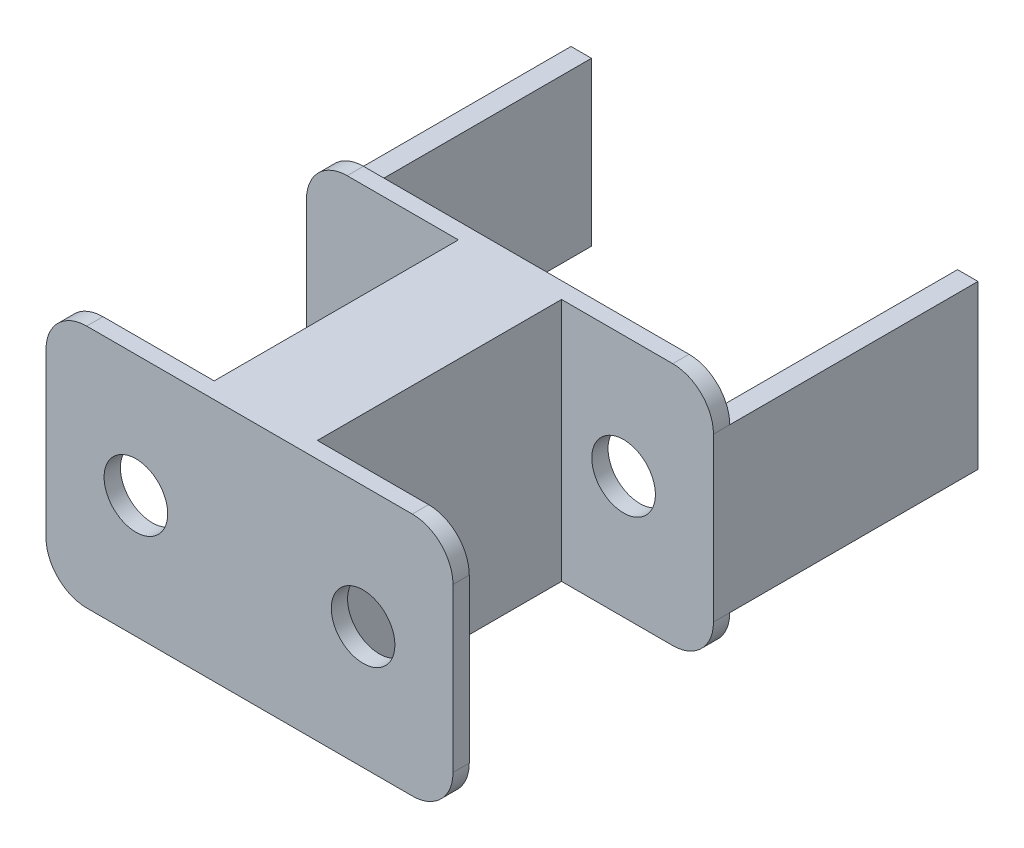
ISO-10303-21;
HEADER;
FILE_DESCRIPTION(('STEP AP214'),'2;1');
FILE_NAME('part.step','',(''),(''),'','','');
FILE_SCHEMA(('AUTOMOTIVE_DESIGN { 1 0 10303 214 1 1 1 1 }'));
ENDSEC;
DATA;
#1=APPLICATION_CONTEXT('core data for automotive mechanical design processes');
#2=APPLICATION_PROTOCOL_DEFINITION('international standard','automotive_design',2000,#1);
#3=PRODUCT_CONTEXT('',#1,'mechanical');
#4=PRODUCT('Part','Part','',(#3));
#5=PRODUCT_RELATED_PRODUCT_CATEGORY('part','',(#4));
#6=PRODUCT_DEFINITION_FORMATION('','',#4);
#7=PRODUCT_DEFINITION_CONTEXT('part definition',#1,'design');
#8=PRODUCT_DEFINITION('design','',#6,#7);
#9=PRODUCT_DEFINITION_SHAPE('','',#8);
#10=(LENGTH_UNIT() NAMED_UNIT(*) SI_UNIT(.MILLI.,.METRE.));
#11=(NAMED_UNIT(*) PLANE_ANGLE_UNIT() SI_UNIT($,.RADIAN.));
#12=(NAMED_UNIT(*) SI_UNIT($,.STERADIAN.) SOLID_ANGLE_UNIT());
#13=UNCERTAINTY_MEASURE_WITH_UNIT(LENGTH_MEASURE(1.E-05),#10,'distance_accuracy_value','');
#14=(GEOMETRIC_REPRESENTATION_CONTEXT(3) GLOBAL_UNCERTAINTY_ASSIGNED_CONTEXT((#13)) GLOBAL_UNIT_ASSIGNED_CONTEXT((#10,
#11,#12)) REPRESENTATION_CONTEXT('',''));
#15=CARTESIAN_POINT('',(0.,0.,0.));
#16=DIRECTION('',(0.,0.,1.));
#17=DIRECTION('',(1.,0.,0.));
#18=AXIS2_PLACEMENT_3D('',#15,#16,#17);
#19=CARTESIAN_POINT('',(-90.,10.,0.));
#20=DIRECTION('',(0.,0.,1.));
#21=DIRECTION('',(1.,0.,0.));
#22=AXIS2_PLACEMENT_3D('',#19,#20,#21);
#23=PLANE('',#22);
#24=CARTESIAN_POINT('',(-77.9117533397812,30.0000000000002,0.));
#25=DIRECTION('',(0.,0.,-1.));
#26=DIRECTION('',(-1.,0.,0.));
#27=AXIS2_PLACEMENT_3D('',#24,#25,#26);
#28=CIRCLE('',#27,7.81529093513876);
#29=CARTESIAN_POINT('',(-85.72704427492,30.0000000000002,0.));
#30=VERTEX_POINT('',#29);
#31=EDGE_CURVE('E288',#30,#30,#28,.T.);
#32=ORIENTED_EDGE('',*,*,#31,.F.);
#33=EDGE_LOOP('',(#32));
#34=FACE_BOUND('',#33,.T.);
#35=CARTESIAN_POINT('',(-22.0882466602188,30.0000000000002,0.));
#36=DIRECTION('',(0.,0.,1.));
#37=DIRECTION('',(1.,0.,0.));
#38=AXIS2_PLACEMENT_3D('',#35,#36,#37);
#39=CIRCLE('',#38,7.81529093513875);
#40=CARTESIAN_POINT('',(-14.27295572508,30.0000000000002,0.));
#41=VERTEX_POINT('',#40);
#42=EDGE_CURVE('E300',#41,#41,#39,.T.);
#43=ORIENTED_EDGE('',*,*,#42,.T.);
#44=EDGE_LOOP('',(#43));
#45=FACE_BOUND('',#44,.T.);
#46=DIRECTION('',(1.,0.,0.));
#47=VECTOR('',#46,1.);
#48=CARTESIAN_POINT('',(-100.,49.9999999999999,0.));
#49=LINE('',#48,#47);
#50=CARTESIAN_POINT('',(-100.,49.9999999999999,0.));
#51=VERTEX_POINT('',#50);
#52=CARTESIAN_POINT('',(-94.9706668128813,49.9999999999999,0.));
#53=VERTEX_POINT('',#52);
#54=EDGE_CURVE('E241',#51,#53,#49,.T.);
#55=ORIENTED_EDGE('',*,*,#54,.F.);
#56=CARTESIAN_POINT('',(-90.,50.,0.));
#57=DIRECTION('',(0.,0.,1.));
#58=DIRECTION('',(1.,0.,0.));
#59=AXIS2_PLACEMENT_3D('',#56,#57,#58);
#60=CIRCLE('',#59,9.99999999999999);
#61=CARTESIAN_POINT('',(-89.9999999999999,60.,0.));
#62=VERTEX_POINT('',#61);
#63=EDGE_CURVE('E405',#62,#51,#60,.T.);
#64=ORIENTED_EDGE('',*,*,#63,.F.);
#65=DIRECTION('',(-1.,0.,0.));
#66=VECTOR('',#65,1.);
#67=CARTESIAN_POINT('',(-89.9999999999999,60.,0.));
#68=LINE('',#67,#66);
#69=CARTESIAN_POINT('',(-10.0000000000001,60.,0.));
#70=VERTEX_POINT('',#69);
#71=EDGE_CURVE('E442',#70,#62,#68,.T.);
#72=ORIENTED_EDGE('',*,*,#71,.F.);
#73=CARTESIAN_POINT('',(-10.,50.,0.));
#74=DIRECTION('',(0.,0.,1.));
#75=DIRECTION('',(1.,0.,0.));
#76=AXIS2_PLACEMENT_3D('',#73,#74,#75);
#77=CIRCLE('',#76,10.);
#78=CARTESIAN_POINT('',(0.,49.9999999999999,0.));
#79=VERTEX_POINT('',#78);
#80=EDGE_CURVE('E438',#79,#70,#77,.T.);
#81=ORIENTED_EDGE('',*,*,#80,.F.);
#82=DIRECTION('',(1.,0.,0.));
#83=VECTOR('',#82,1.);
#84=CARTESIAN_POINT('',(0.,49.9999999999999,0.));
#85=LINE('',#84,#83);
#86=CARTESIAN_POINT('',(-5.02933318711873,49.9999999999999,0.));
#87=VERTEX_POINT('',#86);
#88=EDGE_CURVE('E57',#87,#79,#85,.T.);
#89=ORIENTED_EDGE('',*,*,#88,.F.);
#90=DIRECTION('',(0.,1.,0.));
#91=VECTOR('',#90,1.);
#92=CARTESIAN_POINT('',(-5.02933318711873,49.9999999999999,0.));
#93=LINE('',#92,#91);
#94=CARTESIAN_POINT('',(-5.02933318711873,10.0000000000001,0.));
#95=VERTEX_POINT('',#94);
#96=EDGE_CURVE('E249',#95,#87,#93,.T.);
#97=ORIENTED_EDGE('',*,*,#96,.F.);
#98=DIRECTION('',(-1.,0.,0.));
#99=VECTOR('',#98,1.);
#100=CARTESIAN_POINT('',(0.,10.0000000000001,0.));
#101=LINE('',#100,#99);
#102=CARTESIAN_POINT('',(0.,10.0000000000001,0.));
#103=VERTEX_POINT('',#102);
#104=EDGE_CURVE('E244',#103,#95,#101,.T.);
#105=ORIENTED_EDGE('',*,*,#104,.F.);
#106=CARTESIAN_POINT('',(-10.,10.,0.));
#107=DIRECTION('',(0.,0.,1.));
#108=DIRECTION('',(1.,0.,0.));
#109=AXIS2_PLACEMENT_3D('',#106,#107,#108);
#110=CIRCLE('',#109,10.);
#111=CARTESIAN_POINT('',(-10.0000000000001,0.,0.));
#112=VERTEX_POINT('',#111);
#113=EDGE_CURVE('E434',#112,#103,#110,.T.);
#114=ORIENTED_EDGE('',*,*,#113,.F.);
#115=DIRECTION('',(1.,0.,0.));
#116=VECTOR('',#115,1.);
#117=CARTESIAN_POINT('',(-89.9999999999999,0.,0.));
#118=LINE('',#117,#116);
#119=CARTESIAN_POINT('',(-89.9999999999999,0.,0.));
#120=VERTEX_POINT('',#119);
#121=EDGE_CURVE('E430',#120,#112,#118,.T.);
#122=ORIENTED_EDGE('',*,*,#121,.F.);
#123=CARTESIAN_POINT('',(-90.,10.,0.));
#124=DIRECTION('',(0.,0.,1.));
#125=DIRECTION('',(1.,0.,0.));
#126=AXIS2_PLACEMENT_3D('',#123,#124,#125);
#127=CIRCLE('',#126,10.);
#128=CARTESIAN_POINT('',(-100.,10.0000000000001,0.));
#129=VERTEX_POINT('',#128);
#130=EDGE_CURVE('E399',#129,#120,#127,.T.);
#131=ORIENTED_EDGE('',*,*,#130,.F.);
#132=DIRECTION('',(-1.,0.,0.));
#133=VECTOR('',#132,1.);
#134=CARTESIAN_POINT('',(-100.,10.0000000000001,0.));
#135=LINE('',#134,#133);
#136=CARTESIAN_POINT('',(-94.9706668128813,10.0000000000001,0.));
#137=VERTEX_POINT('',#136);
#138=EDGE_CURVE('E237',#137,#129,#135,.T.);
#139=ORIENTED_EDGE('',*,*,#138,.F.);
#140=DIRECTION('',(0.,-1.,0.));
#141=VECTOR('',#140,1.);
#142=CARTESIAN_POINT('',(-94.9706668128813,49.9999999999999,0.));
#143=LINE('',#142,#141);
#144=EDGE_CURVE('E572',#53,#137,#143,.T.);
#145=ORIENTED_EDGE('',*,*,#144,.F.);
#146=EDGE_LOOP('',(#55,#64,#72,#81,#89,#97,#105,#114,#122,#131,#139,#145));
#147=FACE_BOUND('',#146,.T.);
#148=ADVANCED_FACE('F39',(#34,#45,#147),#23,.F.);
#149=CARTESIAN_POINT('',(-90.,10.,68.));
#150=DIRECTION('',(0.,0.,-1.));
#151=DIRECTION('',(-1.,0.,0.));
#152=AXIS2_PLACEMENT_3D('',#149,#150,#151);
#153=CYLINDRICAL_SURFACE('',#152,10.);
#154=DIRECTION('',(0.,0.,-1.));
#155=VECTOR('',#154,1.);
#156=CARTESIAN_POINT('',(-89.9999999999999,0.,68.));
#157=LINE('',#156,#155);
#158=CARTESIAN_POINT('',(-89.9999999999999,0.,4.));
#159=VERTEX_POINT('',#158);
#160=EDGE_CURVE('E483',#159,#120,#157,.T.);
#161=ORIENTED_EDGE('',*,*,#160,.F.);
#162=CARTESIAN_POINT('',(-90.,10.,4.));
#163=DIRECTION('',(0.,0.,-1.));
#164=DIRECTION('',(-1.,0.,0.));
#165=AXIS2_PLACEMENT_3D('',#162,#163,#164);
#166=CIRCLE('',#165,10.);
#167=CARTESIAN_POINT('',(-100.,10.0000000000001,4.));
#168=VERTEX_POINT('',#167);
#169=EDGE_CURVE('E371',#159,#168,#166,.T.);
#170=ORIENTED_EDGE('',*,*,#169,.T.);
#171=DIRECTION('',(0.,0.,-1.));
#172=VECTOR('',#171,1.);
#173=CARTESIAN_POINT('',(-100.,10.0000000000001,68.));
#174=LINE('',#173,#172);
#175=EDGE_CURVE('E426',#168,#129,#174,.T.);
#176=ORIENTED_EDGE('',*,*,#175,.T.);
#177=ORIENTED_EDGE('',*,*,#130,.T.);
#178=EDGE_LOOP('',(#161,#170,#176,#177));
#179=FACE_BOUND('',#178,.T.);
#180=ADVANCED_FACE('F538',(#179),#153,.T.);
#181=CARTESIAN_POINT('',(-10.,10.,68.));
#182=DIRECTION('',(0.,0.,-1.));
#183=DIRECTION('',(-1.,0.,0.));
#184=AXIS2_PLACEMENT_3D('',#181,#182,#183);
#185=CYLINDRICAL_SURFACE('',#184,10.);
#186=DIRECTION('',(0.,0.,-1.));
#187=VECTOR('',#186,1.);
#188=CARTESIAN_POINT('',(0.,10.0000000000001,68.));
#189=LINE('',#188,#187);
#190=CARTESIAN_POINT('',(0.,10.0000000000001,4.));
#191=VERTEX_POINT('',#190);
#192=EDGE_CURVE('E473',#191,#103,#189,.T.);
#193=ORIENTED_EDGE('',*,*,#192,.F.);
#194=CARTESIAN_POINT('',(-10.,10.,4.));
#195=DIRECTION('',(0.,0.,-1.));
#196=DIRECTION('',(-1.,0.,0.));
#197=AXIS2_PLACEMENT_3D('',#194,#195,#196);
#198=CIRCLE('',#197,10.);
#199=CARTESIAN_POINT('',(-10.,0.,4.));
#200=VERTEX_POINT('',#199);
#201=EDGE_CURVE('E395',#191,#200,#198,.T.);
#202=ORIENTED_EDGE('',*,*,#201,.T.);
#203=DIRECTION('',(0.,0.,-1.));
#204=VECTOR('',#203,1.);
#205=CARTESIAN_POINT('',(-10.0000000000001,0.,68.));
#206=LINE('',#205,#204);
#207=EDGE_CURVE('E478',#200,#112,#206,.T.);
#208=ORIENTED_EDGE('',*,*,#207,.T.);
#209=ORIENTED_EDGE('',*,*,#113,.T.);
#210=EDGE_LOOP('',(#193,#202,#208,#209));
#211=FACE_BOUND('',#210,.T.);
#212=ADVANCED_FACE('F520',(#211),#185,.T.);
#213=CARTESIAN_POINT('',(0.,49.9999999999999,68.));
#214=DIRECTION('',(-1.,0.,0.));
#215=DIRECTION('',(0.,-1.,0.));
#216=AXIS2_PLACEMENT_3D('',#213,#214,#215);
#217=PLANE('',#216);
#218=DIRECTION('',(0.,0.,-1.));
#219=VECTOR('',#218,1.);
#220=CARTESIAN_POINT('',(0.,49.9999999999999,68.));
#221=LINE('',#220,#219);
#222=CARTESIAN_POINT('',(0.,49.9999999999999,4.));
#223=VERTEX_POINT('',#222);
#224=EDGE_CURVE('E468',#223,#79,#221,.T.);
#225=ORIENTED_EDGE('',*,*,#224,.F.);
#226=DIRECTION('',(0.,-1.,0.));
#227=VECTOR('',#226,1.);
#228=CARTESIAN_POINT('',(0.,49.9999999999999,4.));
#229=LINE('',#228,#227);
#230=EDGE_CURVE('E391',#223,#191,#229,.T.);
#231=ORIENTED_EDGE('',*,*,#230,.T.);
#232=ORIENTED_EDGE('',*,*,#192,.T.);
#233=DIRECTION('',(0.,0.,1.));
#234=VECTOR('',#233,1.);
#235=CARTESIAN_POINT('',(0.,10.0000000000001,-61.));
#236=LINE('',#235,#234);
#237=CARTESIAN_POINT('',(0.,10.0000000000001,-61.));
#238=VERTEX_POINT('',#237);
#239=EDGE_CURVE('E284',#238,#103,#236,.T.);
#240=ORIENTED_EDGE('',*,*,#239,.F.);
#241=DIRECTION('',(0.,-1.,0.));
#242=VECTOR('',#241,1.);
#243=CARTESIAN_POINT('',(0.,49.9999999999999,-61.));
#244=LINE('',#243,#242);
#245=CARTESIAN_POINT('',(0.,49.9999999999999,-61.));
#246=VERTEX_POINT('',#245);
#247=EDGE_CURVE('E255',#246,#238,#244,.T.);
#248=ORIENTED_EDGE('',*,*,#247,.F.);
#249=DIRECTION('',(0.,0.,1.));
#250=VECTOR('',#249,1.);
#251=CARTESIAN_POINT('',(0.,49.9999999999999,-61.));
#252=LINE('',#251,#250);
#253=EDGE_CURVE('E267',#246,#79,#252,.T.);
#254=ORIENTED_EDGE('',*,*,#253,.T.);
#255=EDGE_LOOP('',(#225,#231,#232,#240,#248,#254));
#256=FACE_BOUND('',#255,.T.);
#257=ADVANCED_FACE('F622',(#256),#217,.F.);
#258=CARTESIAN_POINT('',(-10.,50.,68.));
#259=DIRECTION('',(0.,0.,-1.));
#260=DIRECTION('',(-1.,0.,0.));
#261=AXIS2_PLACEMENT_3D('',#258,#259,#260);
#262=CYLINDRICAL_SURFACE('',#261,10.);
#263=DIRECTION('',(0.,0.,-1.));
#264=VECTOR('',#263,1.);
#265=CARTESIAN_POINT('',(-10.0000000000001,60.,68.));
#266=LINE('',#265,#264);
#267=CARTESIAN_POINT('',(-10.0000000000001,60.,4.));
#268=VERTEX_POINT('',#267);
#269=EDGE_CURVE('E463',#268,#70,#266,.T.);
#270=ORIENTED_EDGE('',*,*,#269,.F.);
#271=CARTESIAN_POINT('',(-10.,50.,4.));
#272=DIRECTION('',(0.,0.,-1.));
#273=DIRECTION('',(-1.,0.,0.));
#274=AXIS2_PLACEMENT_3D('',#271,#272,#273);
#275=CIRCLE('',#274,10.);
#276=EDGE_CURVE('E387',#268,#223,#275,.T.);
#277=ORIENTED_EDGE('',*,*,#276,.T.);
#278=ORIENTED_EDGE('',*,*,#224,.T.);
#279=ORIENTED_EDGE('',*,*,#80,.T.);
#280=EDGE_LOOP('',(#270,#277,#278,#279));
#281=FACE_BOUND('',#280,.T.);
#282=ADVANCED_FACE('F617',(#281),#262,.T.);
#283=CARTESIAN_POINT('',(-90.,50.,68.));
#284=DIRECTION('',(0.,0.,-1.));
#285=DIRECTION('',(-1.,0.,0.));
#286=AXIS2_PLACEMENT_3D('',#283,#284,#285);
#287=CYLINDRICAL_SURFACE('',#286,9.99999999999999);
#288=DIRECTION('',(0.,0.,-1.));
#289=VECTOR('',#288,1.);
#290=CARTESIAN_POINT('',(-100.,49.9999999999999,68.));
#291=LINE('',#290,#289);
#292=CARTESIAN_POINT('',(-100.,49.9999999999999,4.));
#293=VERTEX_POINT('',#292);
#294=EDGE_CURVE('E453',#293,#51,#291,.T.);
#295=ORIENTED_EDGE('',*,*,#294,.F.);
#296=CARTESIAN_POINT('',(-90.,50.,4.));
#297=DIRECTION('',(0.,0.,-1.));
#298=DIRECTION('',(-1.,0.,0.));
#299=AXIS2_PLACEMENT_3D('',#296,#297,#298);
#300=CIRCLE('',#299,9.99999999999999);
#301=CARTESIAN_POINT('',(-90.,60.,4.));
#302=VERTEX_POINT('',#301);
#303=EDGE_CURVE('E367',#293,#302,#300,.T.);
#304=ORIENTED_EDGE('',*,*,#303,.T.);
#305=DIRECTION('',(0.,0.,-1.));
#306=VECTOR('',#305,1.);
#307=CARTESIAN_POINT('',(-89.9999999999999,60.,68.));
#308=LINE('',#307,#306);
#309=EDGE_CURVE('E458',#302,#62,#308,.T.);
#310=ORIENTED_EDGE('',*,*,#309,.T.);
#311=ORIENTED_EDGE('',*,*,#63,.T.);
#312=EDGE_LOOP('',(#295,#304,#310,#311));
#313=FACE_BOUND('',#312,.T.);
#314=ADVANCED_FACE('F560',(#313),#287,.T.);
#315=CARTESIAN_POINT('',(-100.,49.9999999999999,68.));
#316=DIRECTION('',(1.,0.,0.));
#317=DIRECTION('',(0.,0.,-1.));
#318=AXIS2_PLACEMENT_3D('',#315,#316,#317);
#319=PLANE('',#318);
#320=ORIENTED_EDGE('',*,*,#175,.F.);
#321=DIRECTION('',(0.,1.,0.));
#322=VECTOR('',#321,1.);
#323=CARTESIAN_POINT('',(-100.,49.9999999999999,4.));
#324=LINE('',#323,#322);
#325=EDGE_CURVE('E49',#168,#293,#324,.T.);
#326=ORIENTED_EDGE('',*,*,#325,.T.);
#327=ORIENTED_EDGE('',*,*,#294,.T.);
#328=DIRECTION('',(0.,0.,1.));
#329=VECTOR('',#328,1.);
#330=CARTESIAN_POINT('',(-100.,49.9999999999999,-61.));
#331=LINE('',#330,#329);
#332=CARTESIAN_POINT('',(-100.,49.9999999999999,-61.));
#333=VERTEX_POINT('',#332);
#334=EDGE_CURVE('E563',#333,#51,#331,.T.);
#335=ORIENTED_EDGE('',*,*,#334,.F.);
#336=DIRECTION('',(0.,1.,0.));
#337=VECTOR('',#336,1.);
#338=CARTESIAN_POINT('',(-100.,49.9999999999999,-61.));
#339=LINE('',#338,#337);
#340=CARTESIAN_POINT('',(-100.,10.0000000000001,-61.));
#341=VERTEX_POINT('',#340);
#342=EDGE_CURVE('E233',#341,#333,#339,.T.);
#343=ORIENTED_EDGE('',*,*,#342,.F.);
#344=DIRECTION('',(0.,0.,1.));
#345=VECTOR('',#344,1.);
#346=CARTESIAN_POINT('',(-100.,10.0000000000001,-61.));
#347=LINE('',#346,#345);
#348=EDGE_CURVE('E251',#341,#129,#347,.T.);
#349=ORIENTED_EDGE('',*,*,#348,.T.);
#350=EDGE_LOOP('',(#320,#326,#327,#335,#343,#349));
#351=FACE_BOUND('',#350,.T.);
#352=ADVANCED_FACE('F562',(#351),#319,.F.);
#353=CARTESIAN_POINT('',(-100.,10.0000000000001,68.));
#354=VERTEX_POINT('',#353);
#355=CARTESIAN_POINT('',(-100.,10.0000000000001,64.));
#356=VERTEX_POINT('',#355);
#357=EDGE_CURVE('E449',#354,#356,#174,.T.);
#358=ORIENTED_EDGE('',*,*,#357,.T.);
#359=CARTESIAN_POINT('',(-90.,10.,64.));
#360=DIRECTION('',(0.,0.,1.));
#361=DIRECTION('',(1.,0.,0.));
#362=AXIS2_PLACEMENT_3D('',#359,#360,#361);
#363=CIRCLE('',#362,10.);
#364=CARTESIAN_POINT('',(-89.9999999999999,0.,64.));
#365=VERTEX_POINT('',#364);
#366=EDGE_CURVE('E363',#356,#365,#363,.T.);
#367=ORIENTED_EDGE('',*,*,#366,.T.);
#368=CARTESIAN_POINT('',(-89.9999999999999,0.,68.));
#369=VERTEX_POINT('',#368);
#370=EDGE_CURVE('E484',#369,#365,#157,.T.);
#371=ORIENTED_EDGE('',*,*,#370,.F.);
#372=CARTESIAN_POINT('',(-90.,10.,68.));
#373=DIRECTION('',(0.,0.,1.));
#374=DIRECTION('',(1.,0.,0.));
#375=AXIS2_PLACEMENT_3D('',#372,#373,#374);
#376=CIRCLE('',#375,10.);
#377=EDGE_CURVE('E400',#354,#369,#376,.T.);
#378=ORIENTED_EDGE('',*,*,#377,.F.);
#379=EDGE_LOOP('',(#358,#367,#371,#378));
#380=FACE_BOUND('',#379,.T.);
#381=ADVANCED_FACE('F41',(#380),#153,.T.);
#382=CARTESIAN_POINT('',(-89.9999999999999,0.,68.));
#383=DIRECTION('',(0.,1.,0.));
#384=DIRECTION('',(0.,0.,1.));
#385=AXIS2_PLACEMENT_3D('',#382,#383,#384);
#386=PLANE('',#385);
#387=DIRECTION('',(0.,0.,1.));
#388=VECTOR('',#387,1.);
#389=CARTESIAN_POINT('',(-62.6766138871608,0.,4.));
#390=LINE('',#389,#388);
#391=CARTESIAN_POINT('',(-62.6766138871608,0.,4.));
#392=VERTEX_POINT('',#391);
#393=CARTESIAN_POINT('',(-62.6766138871608,0.,64.));
#394=VERTEX_POINT('',#393);
#395=EDGE_CURVE('E314',#392,#394,#390,.T.);
#396=ORIENTED_EDGE('',*,*,#395,.F.);
#397=DIRECTION('',(1.,0.,0.));
#398=VECTOR('',#397,1.);
#399=CARTESIAN_POINT('',(-111.891703096138,0.,4.));
#400=LINE('',#399,#398);
#401=EDGE_CURVE('E317',#159,#392,#400,.T.);
#402=ORIENTED_EDGE('',*,*,#401,.F.);
#403=ORIENTED_EDGE('',*,*,#160,.T.);
#404=ORIENTED_EDGE('',*,*,#121,.T.);
#405=ORIENTED_EDGE('',*,*,#207,.F.);
#406=DIRECTION('',(1.,0.,0.));
#407=VECTOR('',#406,1.);
#408=CARTESIAN_POINT('',(11.891703096138,0.,4.));
#409=LINE('',#408,#407);
#410=CARTESIAN_POINT('',(-37.3233861128392,0.,4.));
#411=VERTEX_POINT('',#410);
#412=EDGE_CURVE('E345',#411,#200,#409,.T.);
#413=ORIENTED_EDGE('',*,*,#412,.F.);
#414=DIRECTION('',(0.,0.,-1.));
#415=VECTOR('',#414,1.);
#416=CARTESIAN_POINT('',(-37.3233861128392,0.,4.));
#417=LINE('',#416,#415);
#418=CARTESIAN_POINT('',(-37.3233861128392,0.,64.));
#419=VERTEX_POINT('',#418);
#420=EDGE_CURVE('E326',#419,#411,#417,.T.);
#421=ORIENTED_EDGE('',*,*,#420,.F.);
#422=DIRECTION('',(-1.,0.,0.));
#423=VECTOR('',#422,1.);
#424=CARTESIAN_POINT('',(11.8917030961379,0.,64.));
#425=LINE('',#424,#423);
#426=CARTESIAN_POINT('',(-10.,0.,64.));
#427=VERTEX_POINT('',#426);
#428=EDGE_CURVE('E342',#427,#419,#425,.T.);
#429=ORIENTED_EDGE('',*,*,#428,.F.);
#430=CARTESIAN_POINT('',(-10.0000000000001,0.,68.));
#431=VERTEX_POINT('',#430);
#432=EDGE_CURVE('E479',#431,#427,#206,.T.);
#433=ORIENTED_EDGE('',*,*,#432,.F.);
#434=DIRECTION('',(1.,0.,0.));
#435=VECTOR('',#434,1.);
#436=CARTESIAN_POINT('',(-89.9999999999999,0.,68.));
#437=LINE('',#436,#435);
#438=EDGE_CURVE('E404',#369,#431,#437,.T.);
#439=ORIENTED_EDGE('',*,*,#438,.F.);
#440=ORIENTED_EDGE('',*,*,#370,.T.);
#441=DIRECTION('',(-1.,0.,0.));
#442=VECTOR('',#441,1.);
#443=CARTESIAN_POINT('',(-111.891703096138,0.,64.));
#444=LINE('',#443,#442);
#445=EDGE_CURVE('E321',#394,#365,#444,.T.);
#446=ORIENTED_EDGE('',*,*,#445,.F.);
#447=EDGE_LOOP('',(#396,#402,#403,#404,#405,#413,#421,#429,#433,#439,#440,#446));
#448=FACE_BOUND('',#447,.T.);
#449=ADVANCED_FACE('F515',(#448),#386,.F.);
#450=ORIENTED_EDGE('',*,*,#432,.T.);
#451=CARTESIAN_POINT('',(-10.,10.,64.));
#452=DIRECTION('',(0.,0.,1.));
#453=DIRECTION('',(1.,0.,0.));
#454=AXIS2_PLACEMENT_3D('',#451,#452,#453);
#455=CIRCLE('',#454,10.);
#456=CARTESIAN_POINT('',(0.,10.0000000000001,64.));
#457=VERTEX_POINT('',#456);
#458=EDGE_CURVE('E383',#427,#457,#455,.T.);
#459=ORIENTED_EDGE('',*,*,#458,.T.);
#460=CARTESIAN_POINT('',(0.,10.0000000000001,68.));
#461=VERTEX_POINT('',#460);
#462=EDGE_CURVE('E474',#461,#457,#189,.T.);
#463=ORIENTED_EDGE('',*,*,#462,.F.);
#464=CARTESIAN_POINT('',(-10.,10.,68.));
#465=DIRECTION('',(0.,0.,1.));
#466=DIRECTION('',(1.,0.,0.));
#467=AXIS2_PLACEMENT_3D('',#464,#465,#466);
#468=CIRCLE('',#467,10.);
#469=EDGE_CURVE('E408',#431,#461,#468,.T.);
#470=ORIENTED_EDGE('',*,*,#469,.F.);
#471=EDGE_LOOP('',(#450,#459,#463,#470));
#472=FACE_BOUND('',#471,.T.);
#473=ADVANCED_FACE('F620',(#472),#185,.T.);
#474=ORIENTED_EDGE('',*,*,#462,.T.);
#475=DIRECTION('',(0.,1.,0.));
#476=VECTOR('',#475,1.);
#477=CARTESIAN_POINT('',(0.,49.9999999999999,64.));
#478=LINE('',#477,#476);
#479=CARTESIAN_POINT('',(0.,50.,64.));
#480=VERTEX_POINT('',#479);
#481=EDGE_CURVE('E379',#457,#480,#478,.T.);
#482=ORIENTED_EDGE('',*,*,#481,.T.);
#483=CARTESIAN_POINT('',(0.,49.9999999999999,68.));
#484=VERTEX_POINT('',#483);
#485=EDGE_CURVE('E469',#484,#480,#221,.T.);
#486=ORIENTED_EDGE('',*,*,#485,.F.);
#487=DIRECTION('',(0.,1.,0.));
#488=VECTOR('',#487,1.);
#489=CARTESIAN_POINT('',(0.,49.9999999999999,68.));
#490=LINE('',#489,#488);
#491=EDGE_CURVE('E411',#461,#484,#490,.T.);
#492=ORIENTED_EDGE('',*,*,#491,.F.);
#493=EDGE_LOOP('',(#474,#482,#486,#492));
#494=FACE_BOUND('',#493,.T.);
#495=ADVANCED_FACE('F615',(#494),#217,.F.);
#496=ORIENTED_EDGE('',*,*,#485,.T.);
#497=CARTESIAN_POINT('',(-10.,50.,64.));
#498=DIRECTION('',(0.,0.,1.));
#499=DIRECTION('',(1.,0.,0.));
#500=AXIS2_PLACEMENT_3D('',#497,#498,#499);
#501=CIRCLE('',#500,10.);
#502=CARTESIAN_POINT('',(-10.0000000000001,60.,64.));
#503=VERTEX_POINT('',#502);
#504=EDGE_CURVE('E375',#480,#503,#501,.T.);
#505=ORIENTED_EDGE('',*,*,#504,.T.);
#506=CARTESIAN_POINT('',(-10.0000000000001,60.,68.));
#507=VERTEX_POINT('',#506);
#508=EDGE_CURVE('E464',#507,#503,#266,.T.);
#509=ORIENTED_EDGE('',*,*,#508,.F.);
#510=CARTESIAN_POINT('',(-10.,50.,68.));
#511=DIRECTION('',(0.,0.,1.));
#512=DIRECTION('',(1.,0.,0.));
#513=AXIS2_PLACEMENT_3D('',#510,#511,#512);
#514=CIRCLE('',#513,10.);
#515=EDGE_CURVE('E414',#484,#507,#514,.T.);
#516=ORIENTED_EDGE('',*,*,#515,.F.);
#517=EDGE_LOOP('',(#496,#505,#509,#516));
#518=FACE_BOUND('',#517,.T.);
#519=ADVANCED_FACE('F612',(#518),#262,.T.);
#520=CARTESIAN_POINT('',(-89.9999999999999,60.,68.));
#521=DIRECTION('',(0.,-1.,0.));
#522=DIRECTION('',(0.,0.,-1.));
#523=AXIS2_PLACEMENT_3D('',#520,#521,#522);
#524=PLANE('',#523);
#525=ORIENTED_EDGE('',*,*,#309,.F.);
#526=DIRECTION('',(-1.,0.,0.));
#527=VECTOR('',#526,1.);
#528=CARTESIAN_POINT('',(-111.891703096138,60.,4.));
#529=LINE('',#528,#527);
#530=CARTESIAN_POINT('',(-62.6766138871608,60.,4.));
#531=VERTEX_POINT('',#530);
#532=EDGE_CURVE('E330',#531,#302,#529,.T.);
#533=ORIENTED_EDGE('',*,*,#532,.F.);
#534=DIRECTION('',(0.,0.,-1.));
#535=VECTOR('',#534,1.);
#536=CARTESIAN_POINT('',(-62.6766138871608,60.,4.));
#537=LINE('',#536,#535);
#538=CARTESIAN_POINT('',(-62.6766138871608,60.,64.));
#539=VERTEX_POINT('',#538);
#540=EDGE_CURVE('E325',#539,#531,#537,.T.);
#541=ORIENTED_EDGE('',*,*,#540,.F.);
#542=DIRECTION('',(1.,0.,0.));
#543=VECTOR('',#542,1.);
#544=CARTESIAN_POINT('',(-111.891703096138,60.,64.));
#545=LINE('',#544,#543);
#546=CARTESIAN_POINT('',(-90.,60.,64.));
#547=VERTEX_POINT('',#546);
#548=EDGE_CURVE('E322',#547,#539,#545,.T.);
#549=ORIENTED_EDGE('',*,*,#548,.F.);
#550=CARTESIAN_POINT('',(-89.9999999999999,60.,68.));
#551=VERTEX_POINT('',#550);
#552=EDGE_CURVE('E459',#551,#547,#308,.T.);
#553=ORIENTED_EDGE('',*,*,#552,.F.);
#554=DIRECTION('',(-1.,0.,0.));
#555=VECTOR('',#554,1.);
#556=CARTESIAN_POINT('',(-89.9999999999999,60.,68.));
#557=LINE('',#556,#555);
#558=EDGE_CURVE('E417',#507,#551,#557,.T.);
#559=ORIENTED_EDGE('',*,*,#558,.F.);
#560=ORIENTED_EDGE('',*,*,#508,.T.);
#561=DIRECTION('',(1.,0.,0.));
#562=VECTOR('',#561,1.);
#563=CARTESIAN_POINT('',(11.8917030961379,60.,64.));
#564=LINE('',#563,#562);
#565=CARTESIAN_POINT('',(-37.3233861128392,60.,64.));
#566=VERTEX_POINT('',#565);
#567=EDGE_CURVE('E351',#566,#503,#564,.T.);
#568=ORIENTED_EDGE('',*,*,#567,.F.);
#569=DIRECTION('',(0.,0.,1.));
#570=VECTOR('',#569,1.);
#571=CARTESIAN_POINT('',(-37.3233861128392,60.,4.));
#572=LINE('',#571,#570);
#573=CARTESIAN_POINT('',(-37.3233861128392,60.,4.));
#574=VERTEX_POINT('',#573);
#575=EDGE_CURVE('E313',#574,#566,#572,.T.);
#576=ORIENTED_EDGE('',*,*,#575,.F.);
#577=DIRECTION('',(1.,0.,0.));
#578=VECTOR('',#577,1.);
#579=CARTESIAN_POINT('',(-89.9999999999999,60.,4.));
#580=LINE('',#579,#578);
#581=EDGE_CURVE('E11',#574,#268,#580,.T.);
#582=ORIENTED_EDGE('',*,*,#581,.T.);
#583=ORIENTED_EDGE('',*,*,#269,.T.);
#584=ORIENTED_EDGE('',*,*,#71,.T.);
#585=EDGE_LOOP('',(#525,#533,#541,#549,#553,#559,#560,#568,#576,#582,#583,#584));
#586=FACE_BOUND('',#585,.T.);
#587=ADVANCED_FACE('F557',(#586),#524,.F.);
#588=ORIENTED_EDGE('',*,*,#552,.T.);
#589=CARTESIAN_POINT('',(-90.,50.,64.));
#590=DIRECTION('',(0.,0.,1.));
#591=DIRECTION('',(1.,0.,0.));
#592=AXIS2_PLACEMENT_3D('',#589,#590,#591);
#593=CIRCLE('',#592,9.99999999999999);
#594=CARTESIAN_POINT('',(-100.,49.9999999999999,64.));
#595=VERTEX_POINT('',#594);
#596=EDGE_CURVE('E341',#547,#595,#593,.T.);
#597=ORIENTED_EDGE('',*,*,#596,.T.);
#598=CARTESIAN_POINT('',(-100.,49.9999999999999,68.));
#599=VERTEX_POINT('',#598);
#600=EDGE_CURVE('E454',#599,#595,#291,.T.);
#601=ORIENTED_EDGE('',*,*,#600,.F.);
#602=CARTESIAN_POINT('',(-90.,50.,68.));
#603=DIRECTION('',(0.,0.,1.));
#604=DIRECTION('',(1.,0.,0.));
#605=AXIS2_PLACEMENT_3D('',#602,#603,#604);
#606=CIRCLE('',#605,9.99999999999999);
#607=EDGE_CURVE('E420',#551,#599,#606,.T.);
#608=ORIENTED_EDGE('',*,*,#607,.F.);
#609=EDGE_LOOP('',(#588,#597,#601,#608));
#610=FACE_BOUND('',#609,.T.);
#611=ADVANCED_FACE('F605',(#610),#287,.T.);
#612=ORIENTED_EDGE('',*,*,#600,.T.);
#613=DIRECTION('',(0.,-1.,0.));
#614=VECTOR('',#613,1.);
#615=CARTESIAN_POINT('',(-100.,49.9999999999999,64.));
#616=LINE('',#615,#614);
#617=EDGE_CURVE('E488',#595,#356,#616,.T.);
#618=ORIENTED_EDGE('',*,*,#617,.T.);
#619=ORIENTED_EDGE('',*,*,#357,.F.);
#620=DIRECTION('',(0.,-1.,0.));
#621=VECTOR('',#620,1.);
#622=CARTESIAN_POINT('',(-100.,49.9999999999999,68.));
#623=LINE('',#622,#621);
#624=EDGE_CURVE('E423',#599,#354,#623,.T.);
#625=ORIENTED_EDGE('',*,*,#624,.F.);
#626=EDGE_LOOP('',(#612,#618,#619,#625));
#627=FACE_BOUND('',#626,.T.);
#628=ADVANCED_FACE('F602',(#627),#319,.F.);
#629=CARTESIAN_POINT('',(-90.,10.,68.));
#630=DIRECTION('',(0.,0.,1.));
#631=DIRECTION('',(1.,0.,0.));
#632=AXIS2_PLACEMENT_3D('',#629,#630,#631);
#633=PLANE('',#632);
#634=CARTESIAN_POINT('',(-77.9117533397812,30.0000000000002,68.));
#635=DIRECTION('',(0.,0.,1.));
#636=DIRECTION('',(1.,0.,0.));
#637=AXIS2_PLACEMENT_3D('',#634,#635,#636);
#638=CIRCLE('',#637,7.81529093513876);
#639=CARTESIAN_POINT('',(-70.0964624046425,30.0000000000002,68.));
#640=VERTEX_POINT('',#639);
#641=EDGE_CURVE('E292',#640,#640,#638,.F.);
#642=ORIENTED_EDGE('',*,*,#641,.T.);
#643=EDGE_LOOP('',(#642));
#644=FACE_BOUND('',#643,.T.);
#645=CARTESIAN_POINT('',(-22.0882466602188,30.0000000000002,68.));
#646=DIRECTION('',(0.,0.,1.));
#647=DIRECTION('',(1.,0.,0.));
#648=AXIS2_PLACEMENT_3D('',#645,#646,#647);
#649=CIRCLE('',#648,7.81529093513875);
#650=CARTESIAN_POINT('',(-14.27295572508,30.0000000000002,68.));
#651=VERTEX_POINT('',#650);
#652=EDGE_CURVE('E304',#651,#651,#649,.T.);
#653=ORIENTED_EDGE('',*,*,#652,.F.);
#654=EDGE_LOOP('',(#653));
#655=FACE_BOUND('',#654,.T.);
#656=ORIENTED_EDGE('',*,*,#377,.T.);
#657=ORIENTED_EDGE('',*,*,#438,.T.);
#658=ORIENTED_EDGE('',*,*,#469,.T.);
#659=ORIENTED_EDGE('',*,*,#491,.T.);
#660=ORIENTED_EDGE('',*,*,#515,.T.);
#661=ORIENTED_EDGE('',*,*,#558,.T.);
#662=ORIENTED_EDGE('',*,*,#607,.T.);
#663=ORIENTED_EDGE('',*,*,#624,.T.);
#664=EDGE_LOOP('',(#656,#657,#658,#659,#660,#661,#662,#663));
#665=FACE_BOUND('',#664,.T.);
#666=ADVANCED_FACE('F600',(#644,#655,#665),#633,.T.);
#667=CARTESIAN_POINT('',(-111.891703096138,-77.6023518061636,4.));
#668=DIRECTION('',(0.,0.,-1.));
#669=DIRECTION('',(-1.,0.,0.));
#670=AXIS2_PLACEMENT_3D('',#667,#668,#669);
#671=PLANE('',#670);
#672=CARTESIAN_POINT('',(-77.9117533397812,30.0000000000002,4.));
#673=DIRECTION('',(0.,0.,-1.));
#674=DIRECTION('',(-1.,0.,0.));
#675=AXIS2_PLACEMENT_3D('',#672,#673,#674);
#676=CIRCLE('',#675,7.81529093513876);
#677=CARTESIAN_POINT('',(-85.72704427492,30.0000000000002,4.));
#678=VERTEX_POINT('',#677);
#679=EDGE_CURVE('E296',#678,#678,#676,.T.);
#680=ORIENTED_EDGE('',*,*,#679,.T.);
#681=EDGE_LOOP('',(#680));
#682=FACE_BOUND('',#681,.T.);
#683=ORIENTED_EDGE('',*,*,#401,.T.);
#684=DIRECTION('',(0.,1.,0.));
#685=VECTOR('',#684,1.);
#686=CARTESIAN_POINT('',(-62.6766138871608,-77.6023518061636,4.));
#687=LINE('',#686,#685);
#688=EDGE_CURVE('E318',#392,#531,#687,.T.);
#689=ORIENTED_EDGE('',*,*,#688,.T.);
#690=ORIENTED_EDGE('',*,*,#532,.T.);
#691=ORIENTED_EDGE('',*,*,#303,.F.);
#692=ORIENTED_EDGE('',*,*,#325,.F.);
#693=ORIENTED_EDGE('',*,*,#169,.F.);
#694=EDGE_LOOP('',(#683,#689,#690,#691,#692,#693));
#695=FACE_BOUND('',#694,.T.);
#696=ADVANCED_FACE('F548',(#682,#695),#671,.F.);
#697=CARTESIAN_POINT('',(-111.891703096138,-77.6023518061636,64.));
#698=DIRECTION('',(0.,0.,1.));
#699=DIRECTION('',(1.,0.,0.));
#700=AXIS2_PLACEMENT_3D('',#697,#698,#699);
#701=PLANE('',#700);
#702=CARTESIAN_POINT('',(-77.9117533397812,30.0000000000002,64.));
#703=DIRECTION('',(0.,0.,1.));
#704=DIRECTION('',(1.,0.,0.));
#705=AXIS2_PLACEMENT_3D('',#702,#703,#704);
#706=CIRCLE('',#705,7.81529093513876);
#707=CARTESIAN_POINT('',(-70.0964624046425,30.0000000000002,64.));
#708=VERTEX_POINT('',#707);
#709=EDGE_CURVE('E43',#708,#708,#706,.T.);
#710=ORIENTED_EDGE('',*,*,#709,.T.);
#711=EDGE_LOOP('',(#710));
#712=FACE_BOUND('',#711,.T.);
#713=ORIENTED_EDGE('',*,*,#617,.F.);
#714=ORIENTED_EDGE('',*,*,#596,.F.);
#715=ORIENTED_EDGE('',*,*,#548,.T.);
#716=DIRECTION('',(0.,1.,0.));
#717=VECTOR('',#716,1.);
#718=CARTESIAN_POINT('',(-62.6766138871608,-77.6023518061636,64.));
#719=LINE('',#718,#717);
#720=EDGE_CURVE('E333',#394,#539,#719,.T.);
#721=ORIENTED_EDGE('',*,*,#720,.F.);
#722=ORIENTED_EDGE('',*,*,#445,.T.);
#723=ORIENTED_EDGE('',*,*,#366,.F.);
#724=EDGE_LOOP('',(#713,#714,#715,#721,#722,#723));
#725=FACE_BOUND('',#724,.T.);
#726=ADVANCED_FACE('F640',(#712,#725),#701,.F.);
#727=CARTESIAN_POINT('',(-62.6766138871608,-77.6023518061636,4.));
#728=DIRECTION('',(1.,0.,0.));
#729=DIRECTION('',(0.,0.,-1.));
#730=AXIS2_PLACEMENT_3D('',#727,#728,#729);
#731=PLANE('',#730);
#732=ORIENTED_EDGE('',*,*,#395,.T.);
#733=ORIENTED_EDGE('',*,*,#720,.T.);
#734=ORIENTED_EDGE('',*,*,#540,.T.);
#735=ORIENTED_EDGE('',*,*,#688,.F.);
#736=EDGE_LOOP('',(#732,#733,#734,#735));
#737=FACE_BOUND('',#736,.T.);
#738=ADVANCED_FACE('F550',(#737),#731,.F.);
#739=CARTESIAN_POINT('',(11.891703096138,-77.6023518061636,4.));
#740=DIRECTION('',(0.,0.,-1.));
#741=DIRECTION('',(-1.,0.,0.));
#742=AXIS2_PLACEMENT_3D('',#739,#740,#741);
#743=PLANE('',#742);
#744=CARTESIAN_POINT('',(-22.0882466602188,30.0000000000002,4.));
#745=DIRECTION('',(0.,0.,-1.));
#746=DIRECTION('',(-1.,0.,0.));
#747=AXIS2_PLACEMENT_3D('',#744,#745,#746);
#748=CIRCLE('',#747,7.81529093513875);
#749=CARTESIAN_POINT('',(-29.9035375953575,30.0000000000002,4.));
#750=VERTEX_POINT('',#749);
#751=EDGE_CURVE('E309',#750,#750,#748,.F.);
#752=ORIENTED_EDGE('',*,*,#751,.F.);
#753=EDGE_LOOP('',(#752));
#754=FACE_BOUND('',#753,.T.);
#755=ORIENTED_EDGE('',*,*,#230,.F.);
#756=ORIENTED_EDGE('',*,*,#276,.F.);
#757=ORIENTED_EDGE('',*,*,#581,.F.);
#758=DIRECTION('',(0.,1.,0.));
#759=VECTOR('',#758,1.);
#760=CARTESIAN_POINT('',(-37.3233861128392,-77.6023518061636,4.));
#761=LINE('',#760,#759);
#762=EDGE_CURVE('E65',#411,#574,#761,.T.);
#763=ORIENTED_EDGE('',*,*,#762,.F.);
#764=ORIENTED_EDGE('',*,*,#412,.T.);
#765=ORIENTED_EDGE('',*,*,#201,.F.);
#766=EDGE_LOOP('',(#755,#756,#757,#763,#764,#765));
#767=FACE_BOUND('',#766,.T.);
#768=ADVANCED_FACE('F504',(#754,#767),#743,.F.);
#769=CARTESIAN_POINT('',(11.8917030961379,-77.6023518061636,64.));
#770=DIRECTION('',(0.,0.,1.));
#771=DIRECTION('',(1.,0.,0.));
#772=AXIS2_PLACEMENT_3D('',#769,#770,#771);
#773=PLANE('',#772);
#774=CARTESIAN_POINT('',(-22.0882466602188,30.0000000000002,64.));
#775=DIRECTION('',(0.,0.,1.));
#776=DIRECTION('',(1.,0.,0.));
#777=AXIS2_PLACEMENT_3D('',#774,#775,#776);
#778=CIRCLE('',#777,7.81529093513875);
#779=CARTESIAN_POINT('',(-14.27295572508,30.0000000000002,64.));
#780=VERTEX_POINT('',#779);
#781=EDGE_CURVE('E308',#780,#780,#778,.F.);
#782=ORIENTED_EDGE('',*,*,#781,.F.);
#783=EDGE_LOOP('',(#782));
#784=FACE_BOUND('',#783,.T.);
#785=ORIENTED_EDGE('',*,*,#428,.T.);
#786=DIRECTION('',(0.,1.,0.));
#787=VECTOR('',#786,1.);
#788=CARTESIAN_POINT('',(-37.3233861128392,-77.6023518061636,64.));
#789=LINE('',#788,#787);
#790=EDGE_CURVE('E346',#419,#566,#789,.T.);
#791=ORIENTED_EDGE('',*,*,#790,.T.);
#792=ORIENTED_EDGE('',*,*,#567,.T.);
#793=ORIENTED_EDGE('',*,*,#504,.F.);
#794=ORIENTED_EDGE('',*,*,#481,.F.);
#795=ORIENTED_EDGE('',*,*,#458,.F.);
#796=EDGE_LOOP('',(#785,#791,#792,#793,#794,#795));
#797=FACE_BOUND('',#796,.T.);
#798=ADVANCED_FACE('F500',(#784,#797),#773,.F.);
#799=CARTESIAN_POINT('',(-37.3233861128392,-77.6023518061636,4.));
#800=DIRECTION('',(-1.,0.,0.));
#801=DIRECTION('',(0.,0.,1.));
#802=AXIS2_PLACEMENT_3D('',#799,#800,#801);
#803=PLANE('',#802);
#804=ORIENTED_EDGE('',*,*,#420,.T.);
#805=ORIENTED_EDGE('',*,*,#762,.T.);
#806=ORIENTED_EDGE('',*,*,#575,.T.);
#807=ORIENTED_EDGE('',*,*,#790,.F.);
#808=EDGE_LOOP('',(#804,#805,#806,#807));
#809=FACE_BOUND('',#808,.T.);
#810=ADVANCED_FACE('F503',(#809),#803,.F.);
#811=CARTESIAN_POINT('',(-22.0882466602188,30.0000000000002,90.1049808687295));
#812=DIRECTION('',(0.,0.,-1.));
#813=DIRECTION('',(-1.,0.,0.));
#814=AXIS2_PLACEMENT_3D('',#811,#812,#813);
#815=CYLINDRICAL_SURFACE('',#814,7.81529093513875);
#816=ORIENTED_EDGE('',*,*,#652,.T.);
#817=EDGE_LOOP('',(#816));
#818=FACE_BOUND('',#817,.T.);
#819=ORIENTED_EDGE('',*,*,#781,.T.);
#820=EDGE_LOOP('',(#819));
#821=FACE_BOUND('',#820,.T.);
#822=ADVANCED_FACE('F498',(#818,#821),#815,.F.);
#823=ORIENTED_EDGE('',*,*,#42,.F.);
#824=EDGE_LOOP('',(#823));
#825=FACE_BOUND('',#824,.T.);
#826=ORIENTED_EDGE('',*,*,#751,.T.);
#827=EDGE_LOOP('',(#826));
#828=FACE_BOUND('',#827,.T.);
#829=ADVANCED_FACE('F682',(#825,#828),#815,.F.);
#830=CARTESIAN_POINT('',(-77.9117533397812,30.0000000000002,90.1049808687295));
#831=DIRECTION('',(0.,0.,-1.));
#832=DIRECTION('',(-1.,0.,0.));
#833=AXIS2_PLACEMENT_3D('',#830,#831,#832);
#834=CYLINDRICAL_SURFACE('',#833,7.81529093513876);
#835=ORIENTED_EDGE('',*,*,#641,.F.);
#836=EDGE_LOOP('',(#835));
#837=FACE_BOUND('',#836,.T.);
#838=ORIENTED_EDGE('',*,*,#709,.F.);
#839=EDGE_LOOP('',(#838));
#840=FACE_BOUND('',#839,.T.);
#841=ADVANCED_FACE('F677',(#837,#840),#834,.F.);
#842=ORIENTED_EDGE('',*,*,#31,.T.);
#843=EDGE_LOOP('',(#842));
#844=FACE_BOUND('',#843,.T.);
#845=ORIENTED_EDGE('',*,*,#679,.F.);
#846=EDGE_LOOP('',(#845));
#847=FACE_BOUND('',#846,.T.);
#848=ADVANCED_FACE('F670',(#844,#847),#834,.F.);
#849=CARTESIAN_POINT('',(0.,10.0000000000001,-61.));
#850=DIRECTION('',(0.,1.,0.));
#851=DIRECTION('',(0.,0.,1.));
#852=AXIS2_PLACEMENT_3D('',#849,#850,#851);
#853=PLANE('',#852);
#854=ORIENTED_EDGE('',*,*,#104,.T.);
#855=DIRECTION('',(0.,0.,1.));
#856=VECTOR('',#855,1.);
#857=CARTESIAN_POINT('',(-5.02933318711873,10.0000000000001,-61.));
#858=LINE('',#857,#856);
#859=CARTESIAN_POINT('',(-5.02933318711873,10.0000000000001,-61.));
#860=VERTEX_POINT('',#859);
#861=EDGE_CURVE('E280',#860,#95,#858,.T.);
#862=ORIENTED_EDGE('',*,*,#861,.F.);
#863=DIRECTION('',(-1.,0.,0.));
#864=VECTOR('',#863,1.);
#865=CARTESIAN_POINT('',(0.,10.0000000000001,-61.));
#866=LINE('',#865,#864);
#867=EDGE_CURVE('E259',#238,#860,#866,.T.);
#868=ORIENTED_EDGE('',*,*,#867,.F.);
#869=ORIENTED_EDGE('',*,*,#239,.T.);
#870=EDGE_LOOP('',(#854,#862,#868,#869));
#871=FACE_BOUND('',#870,.T.);
#872=ADVANCED_FACE('F668',(#871),#853,.F.);
#873=CARTESIAN_POINT('',(-5.02933318711873,49.9999999999999,-61.));
#874=DIRECTION('',(1.,0.,0.));
#875=DIRECTION('',(0.,0.,-1.));
#876=AXIS2_PLACEMENT_3D('',#873,#874,#875);
#877=PLANE('',#876);
#878=ORIENTED_EDGE('',*,*,#96,.T.);
#879=DIRECTION('',(0.,0.,1.));
#880=VECTOR('',#879,1.);
#881=CARTESIAN_POINT('',(-5.02933318711873,49.9999999999999,-61.));
#882=LINE('',#881,#880);
#883=CARTESIAN_POINT('',(-5.02933318711873,49.9999999999999,-61.));
#884=VERTEX_POINT('',#883);
#885=EDGE_CURVE('E276',#884,#87,#882,.T.);
#886=ORIENTED_EDGE('',*,*,#885,.F.);
#887=DIRECTION('',(0.,1.,0.));
#888=VECTOR('',#887,1.);
#889=CARTESIAN_POINT('',(-5.02933318711873,49.9999999999999,-61.));
#890=LINE('',#889,#888);
#891=EDGE_CURVE('E262',#860,#884,#890,.T.);
#892=ORIENTED_EDGE('',*,*,#891,.F.);
#893=ORIENTED_EDGE('',*,*,#861,.T.);
#894=EDGE_LOOP('',(#878,#886,#892,#893));
#895=FACE_BOUND('',#894,.T.);
#896=ADVANCED_FACE('F666',(#895),#877,.F.);
#897=CARTESIAN_POINT('',(0.,49.9999999999999,-61.));
#898=DIRECTION('',(0.,-1.,0.));
#899=DIRECTION('',(0.,0.,-1.));
#900=AXIS2_PLACEMENT_3D('',#897,#898,#899);
#901=PLANE('',#900);
#902=ORIENTED_EDGE('',*,*,#88,.T.);
#903=ORIENTED_EDGE('',*,*,#253,.F.);
#904=DIRECTION('',(1.,0.,0.));
#905=VECTOR('',#904,1.);
#906=CARTESIAN_POINT('',(0.,49.9999999999999,-61.));
#907=LINE('',#906,#905);
#908=EDGE_CURVE('E265',#884,#246,#907,.T.);
#909=ORIENTED_EDGE('',*,*,#908,.F.);
#910=ORIENTED_EDGE('',*,*,#885,.T.);
#911=EDGE_LOOP('',(#902,#903,#909,#910));
#912=FACE_BOUND('',#911,.T.);
#913=ADVANCED_FACE('F657',(#912),#901,.F.);
#914=CARTESIAN_POINT('',(0.,0.,-61.));
#915=DIRECTION('',(0.,0.,-1.));
#916=DIRECTION('',(-1.,0.,0.));
#917=AXIS2_PLACEMENT_3D('',#914,#915,#916);
#918=PLANE('',#917);
#919=ORIENTED_EDGE('',*,*,#247,.T.);
#920=ORIENTED_EDGE('',*,*,#867,.T.);
#921=ORIENTED_EDGE('',*,*,#891,.T.);
#922=ORIENTED_EDGE('',*,*,#908,.T.);
#923=EDGE_LOOP('',(#919,#920,#921,#922));
#924=FACE_BOUND('',#923,.T.);
#925=ADVANCED_FACE('F662',(#924),#918,.T.);
#926=CARTESIAN_POINT('',(-100.,49.9999999999999,-61.));
#927=DIRECTION('',(0.,-1.,0.));
#928=DIRECTION('',(0.,0.,-1.));
#929=AXIS2_PLACEMENT_3D('',#926,#927,#928);
#930=PLANE('',#929);
#931=ORIENTED_EDGE('',*,*,#54,.T.);
#932=DIRECTION('',(0.,0.,1.));
#933=VECTOR('',#932,1.);
#934=CARTESIAN_POINT('',(-94.9706668128813,49.9999999999999,-61.));
#935=LINE('',#934,#933);
#936=CARTESIAN_POINT('',(-94.9706668128813,49.9999999999999,-61.));
#937=VERTEX_POINT('',#936);
#938=EDGE_CURVE('E220',#937,#53,#935,.T.);
#939=ORIENTED_EDGE('',*,*,#938,.F.);
#940=DIRECTION('',(1.,0.,0.));
#941=VECTOR('',#940,1.);
#942=CARTESIAN_POINT('',(-100.,49.9999999999999,-61.));
#943=LINE('',#942,#941);
#944=EDGE_CURVE('E228',#333,#937,#943,.T.);
#945=ORIENTED_EDGE('',*,*,#944,.F.);
#946=ORIENTED_EDGE('',*,*,#334,.T.);
#947=EDGE_LOOP('',(#931,#939,#945,#946));
#948=FACE_BOUND('',#947,.T.);
#949=ADVANCED_FACE('F239',(#948),#930,.F.);
#950=CARTESIAN_POINT('',(-94.9706668128813,49.9999999999999,-61.));
#951=DIRECTION('',(-1.,0.,0.));
#952=DIRECTION('',(0.,-1.,0.));
#953=AXIS2_PLACEMENT_3D('',#950,#951,#952);
#954=PLANE('',#953);
#955=ORIENTED_EDGE('',*,*,#144,.T.);
#956=DIRECTION('',(0.,0.,1.));
#957=VECTOR('',#956,1.);
#958=CARTESIAN_POINT('',(-94.9706668128813,10.0000000000001,-61.));
#959=LINE('',#958,#957);
#960=CARTESIAN_POINT('',(-94.9706668128813,10.0000000000001,-61.));
#961=VERTEX_POINT('',#960);
#962=EDGE_CURVE('E223',#961,#137,#959,.T.);
#963=ORIENTED_EDGE('',*,*,#962,.F.);
#964=DIRECTION('',(0.,-1.,0.));
#965=VECTOR('',#964,1.);
#966=CARTESIAN_POINT('',(-94.9706668128813,49.9999999999999,-61.));
#967=LINE('',#966,#965);
#968=EDGE_CURVE('E216',#937,#961,#967,.T.);
#969=ORIENTED_EDGE('',*,*,#968,.F.);
#970=ORIENTED_EDGE('',*,*,#938,.T.);
#971=EDGE_LOOP('',(#955,#963,#969,#970));
#972=FACE_BOUND('',#971,.T.);
#973=ADVANCED_FACE('F218',(#972),#954,.F.);
#974=CARTESIAN_POINT('',(-100.,10.0000000000001,-61.));
#975=DIRECTION('',(0.,1.,0.));
#976=DIRECTION('',(0.,0.,1.));
#977=AXIS2_PLACEMENT_3D('',#974,#975,#976);
#978=PLANE('',#977);
#979=ORIENTED_EDGE('',*,*,#138,.T.);
#980=ORIENTED_EDGE('',*,*,#348,.F.);
#981=DIRECTION('',(-1.,0.,0.));
#982=VECTOR('',#981,1.);
#983=CARTESIAN_POINT('',(-100.,10.0000000000001,-61.));
#984=LINE('',#983,#982);
#985=EDGE_CURVE('E227',#961,#341,#984,.T.);
#986=ORIENTED_EDGE('',*,*,#985,.F.);
#987=ORIENTED_EDGE('',*,*,#962,.T.);
#988=EDGE_LOOP('',(#979,#980,#986,#987));
#989=FACE_BOUND('',#988,.T.);
#990=ADVANCED_FACE('F580',(#989),#978,.F.);
#991=CARTESIAN_POINT('',(0.,0.,-61.));
#992=DIRECTION('',(0.,0.,-1.));
#993=DIRECTION('',(-1.,0.,0.));
#994=AXIS2_PLACEMENT_3D('',#991,#992,#993);
#995=PLANE('',#994);
#996=ORIENTED_EDGE('',*,*,#944,.T.);
#997=ORIENTED_EDGE('',*,*,#968,.T.);
#998=ORIENTED_EDGE('',*,*,#985,.T.);
#999=ORIENTED_EDGE('',*,*,#342,.T.);
#1000=EDGE_LOOP('',(#996,#997,#998,#999));
#1001=FACE_BOUND('',#1000,.T.);
#1002=ADVANCED_FACE('F231',(#1001),#995,.T.);
#1003=CLOSED_SHELL('',(#148,#180,#212,#257,#282,#314,#352,#381,#449,#473,#495,#519,#587,#611,
#628,#666,#696,#726,#738,#768,#798,#810,#822,#829,#841,#848,#872,#896,#913,#925,#949,#973,#990,#1002));
#1004=MANIFOLD_SOLID_BREP('B2',#1003);
#1005=ADVANCED_BREP_SHAPE_REPRESENTATION('',(#18,#1004),#14);
#1006=SHAPE_DEFINITION_REPRESENTATION(#9,#1005);
ENDSEC;
END-ISO-10303-21;
